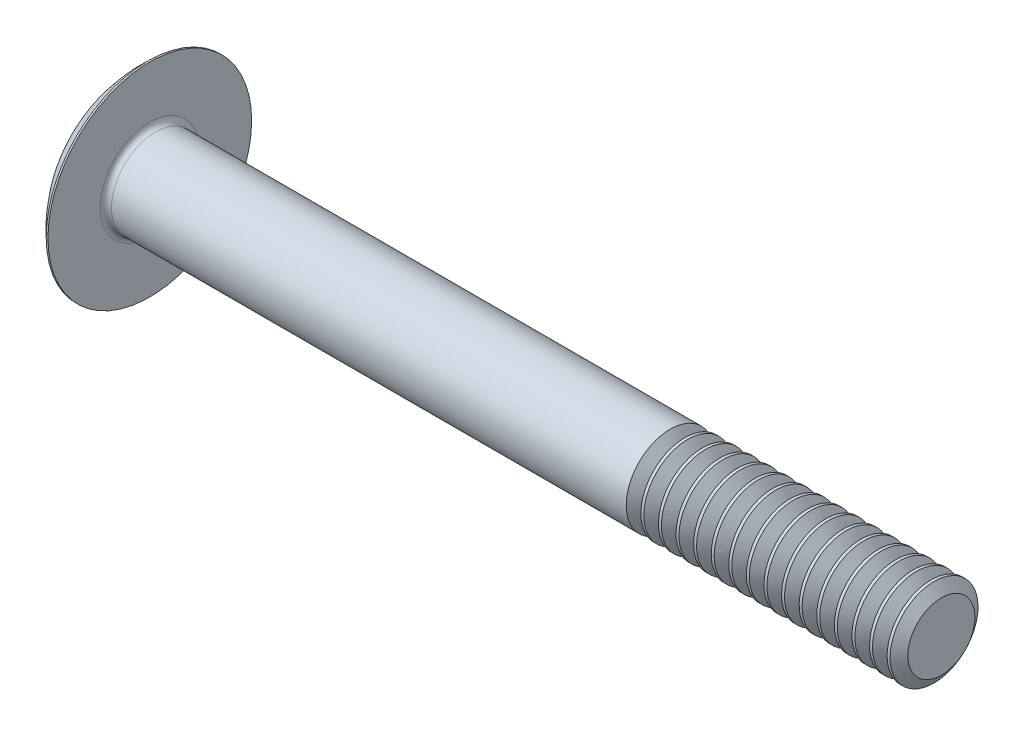
ISO-10303-21;
HEADER;
FILE_DESCRIPTION(('STEP AP214'),'2;1');
FILE_NAME('part.step','',(''),(''),'','','');
FILE_SCHEMA(('AUTOMOTIVE_DESIGN { 1 0 10303 214 1 1 1 1 }'));
ENDSEC;
DATA;
#1=APPLICATION_CONTEXT('core data for automotive mechanical design processes');
#2=APPLICATION_PROTOCOL_DEFINITION('international standard','automotive_design',2000,#1);
#3=PRODUCT_CONTEXT('',#1,'mechanical');
#4=PRODUCT('Part','Part','',(#3));
#5=PRODUCT_RELATED_PRODUCT_CATEGORY('part','',(#4));
#6=PRODUCT_DEFINITION_FORMATION('','',#4);
#7=PRODUCT_DEFINITION_CONTEXT('part definition',#1,'design');
#8=PRODUCT_DEFINITION('design','',#6,#7);
#9=PRODUCT_DEFINITION_SHAPE('','',#8);
#10=(LENGTH_UNIT() NAMED_UNIT(*) SI_UNIT(.MILLI.,.METRE.));
#11=(NAMED_UNIT(*) PLANE_ANGLE_UNIT() SI_UNIT($,.RADIAN.));
#12=(NAMED_UNIT(*) SI_UNIT($,.STERADIAN.) SOLID_ANGLE_UNIT());
#13=UNCERTAINTY_MEASURE_WITH_UNIT(LENGTH_MEASURE(1.E-05),#10,'distance_accuracy_value','');
#14=(GEOMETRIC_REPRESENTATION_CONTEXT(3) GLOBAL_UNCERTAINTY_ASSIGNED_CONTEXT((#13)) GLOBAL_UNIT_ASSIGNED_CONTEXT((#10,
#11,#12)) REPRESENTATION_CONTEXT('',''));
#15=CARTESIAN_POINT('',(0.,0.,0.));
#16=DIRECTION('',(0.,0.,1.));
#17=DIRECTION('',(1.,0.,0.));
#18=AXIS2_PLACEMENT_3D('',#15,#16,#17);
#19=CARTESIAN_POINT('',(9.83861673076924,0.,0.));
#20=DIRECTION('',(-1.,0.,0.));
#21=DIRECTION('',(0.,1.,0.));
#22=AXIS2_PLACEMENT_3D('',#19,#20,#21);
#23=SPHERICAL_SURFACE('',#22,9.83861673076924);
#24=CARTESIAN_POINT('',(3.302,0.,0.));
#25=DIRECTION('',(-1.,0.,0.));
#26=DIRECTION('',(0.,0.,1.));
#27=AXIS2_PLACEMENT_3D('',#24,#25,#26);
#28=CIRCLE('',#27,7.3533);
#29=CARTESIAN_POINT('',(3.302,0.,7.3533));
#30=VERTEX_POINT('',#29);
#31=EDGE_CURVE('E57',#30,#30,#28,.T.);
#32=ORIENTED_EDGE('',*,*,#31,.T.);
#33=EDGE_LOOP('',(#32));
#34=FACE_BOUND('',#33,.T.);
#35=ADVANCED_FACE('F38',(#34),#23,.T.);
#36=CARTESIAN_POINT('',(0.,0.,0.));
#37=DIRECTION('',(-1.,0.,0.));
#38=DIRECTION('',(0.,0.,1.));
#39=AXIS2_PLACEMENT_3D('',#36,#37,#38);
#40=CYLINDRICAL_SURFACE('',#39,3.175);
#41=CARTESIAN_POINT('',(40.9998881737518,0.,0.));
#42=DIRECTION('',(-1.,0.,0.));
#43=DIRECTION('',(0.,-1.,0.));
#44=AXIS2_PLACEMENT_3D('',#41,#42,#43);
#45=CIRCLE('',#44,3.17500000000001);
#46=CARTESIAN_POINT('',(40.9998881737518,-3.175,0.));
#47=VERTEX_POINT('',#46);
#48=EDGE_CURVE('E67',#47,#47,#45,.T.);
#49=ORIENTED_EDGE('',*,*,#48,.T.);
#50=EDGE_LOOP('',(#49));
#51=FACE_BOUND('',#50,.T.);
#52=CARTESIAN_POINT('',(3.8354,0.,0.));
#53=DIRECTION('',(-1.,0.,0.));
#54=DIRECTION('',(0.,0.,1.));
#55=AXIS2_PLACEMENT_3D('',#52,#53,#54);
#56=CIRCLE('',#55,3.175);
#57=CARTESIAN_POINT('',(3.8354,0.,3.175));
#58=VERTEX_POINT('',#57);
#59=EDGE_CURVE('E10',#58,#58,#56,.T.);
#60=ORIENTED_EDGE('',*,*,#59,.F.);
#61=EDGE_LOOP('',(#60));
#62=FACE_BOUND('',#61,.T.);
#63=ADVANCED_FACE('F265',(#51,#62),#40,.T.);
#64=CARTESIAN_POINT('',(3.8354,0.,0.));
#65=DIRECTION('',(-1.,0.,0.));
#66=DIRECTION('',(0.,0.,1.));
#67=AXIS2_PLACEMENT_3D('',#64,#65,#66);
#68=TOROIDAL_SURFACE('',#67,3.5814,0.406399999999999);
#69=CARTESIAN_POINT('',(3.429,0.,0.));
#70=DIRECTION('',(-1.,0.,0.));
#71=DIRECTION('',(0.,0.,1.));
#72=AXIS2_PLACEMENT_3D('',#69,#70,#71);
#73=CIRCLE('',#72,3.5814);
#74=CARTESIAN_POINT('',(3.429,0.,3.5814));
#75=VERTEX_POINT('',#74);
#76=EDGE_CURVE('E45',#75,#75,#73,.T.);
#77=ORIENTED_EDGE('',*,*,#76,.F.);
#78=EDGE_LOOP('',(#77));
#79=FACE_BOUND('',#78,.T.);
#80=ORIENTED_EDGE('',*,*,#59,.T.);
#81=EDGE_LOOP('',(#80));
#82=FACE_BOUND('',#81,.T.);
#83=ADVANCED_FACE('F270',(#79,#82),#68,.F.);
#84=CARTESIAN_POINT('',(3.429,7.3533,0.));
#85=DIRECTION('',(1.,0.,0.));
#86=DIRECTION('',(0.,0.,-1.));
#87=AXIS2_PLACEMENT_3D('',#84,#85,#86);
#88=PLANE('',#87);
#89=ORIENTED_EDGE('',*,*,#76,.T.);
#90=EDGE_LOOP('',(#89));
#91=FACE_BOUND('',#90,.T.);
#92=CARTESIAN_POINT('',(3.429,0.,0.));
#93=DIRECTION('',(-1.,0.,0.));
#94=DIRECTION('',(0.,0.,1.));
#95=AXIS2_PLACEMENT_3D('',#92,#93,#94);
#96=CIRCLE('',#95,7.3533);
#97=CARTESIAN_POINT('',(3.429,0.,7.3533));
#98=VERTEX_POINT('',#97);
#99=EDGE_CURVE('E51',#98,#98,#96,.T.);
#100=ORIENTED_EDGE('',*,*,#99,.F.);
#101=EDGE_LOOP('',(#100));
#102=FACE_BOUND('',#101,.T.);
#103=ADVANCED_FACE('F279',(#91,#102),#88,.T.);
#104=CARTESIAN_POINT('',(0.,0.,0.));
#105=DIRECTION('',(-1.,0.,0.));
#106=DIRECTION('',(0.,0.,1.));
#107=AXIS2_PLACEMENT_3D('',#104,#105,#106);
#108=CYLINDRICAL_SURFACE('',#107,7.3533);
#109=ORIENTED_EDGE('',*,*,#31,.F.);
#110=EDGE_LOOP('',(#109));
#111=FACE_BOUND('',#110,.T.);
#112=ORIENTED_EDGE('',*,*,#99,.T.);
#113=EDGE_LOOP('',(#112));
#114=FACE_BOUND('',#113,.T.);
#115=ADVANCED_FACE('F275',(#111,#114),#108,.T.);
#116=CARTESIAN_POINT('',(42.0581118262482,0.,0.));
#117=DIRECTION('',(1.,0.,0.));
#118=DIRECTION('',(0.,1.,0.));
#119=AXIS2_PLACEMENT_3D('',#116,#117,#118);
#120=CONICAL_SURFACE('',#119,3.17500000000001,0.959931088596882);
#121=CARTESIAN_POINT('',(41.529,0.,0.));
#122=DIRECTION('',(-1.,0.,0.));
#123=DIRECTION('',(0.,-1.,0.));
#124=AXIS2_PLACEMENT_3D('',#121,#122,#123);
#125=CIRCLE('',#124,2.41935000000001);
#126=CARTESIAN_POINT('',(41.529,-2.41935,0.));
#127=VERTEX_POINT('',#126);
#128=EDGE_CURVE('E71',#127,#127,#125,.T.);
#129=ORIENTED_EDGE('',*,*,#128,.F.);
#130=EDGE_LOOP('',(#129));
#131=FACE_BOUND('',#130,.T.);
#132=CARTESIAN_POINT('',(42.0581118262482,0.,0.));
#133=DIRECTION('',(-1.,0.,0.));
#134=DIRECTION('',(0.,-1.,0.));
#135=AXIS2_PLACEMENT_3D('',#132,#133,#134);
#136=CIRCLE('',#135,3.17500000000001);
#137=CARTESIAN_POINT('',(42.0581118262482,-3.175,0.));
#138=VERTEX_POINT('',#137);
#139=EDGE_CURVE('E63',#138,#138,#136,.T.);
#140=ORIENTED_EDGE('',*,*,#139,.T.);
#141=EDGE_LOOP('',(#140));
#142=FACE_BOUND('',#141,.T.);
#143=ADVANCED_FACE('F278',(#131,#142),#120,.T.);
#144=CARTESIAN_POINT('',(41.529,0.,0.));
#145=DIRECTION('',(-1.,0.,0.));
#146=DIRECTION('',(0.,-1.,0.));
#147=AXIS2_PLACEMENT_3D('',#144,#145,#146);
#148=CONICAL_SURFACE('',#147,2.41935000000001,0.959931088596876);
#149=ORIENTED_EDGE('',*,*,#48,.F.);
#150=EDGE_LOOP('',(#149));
#151=FACE_BOUND('',#150,.T.);
#152=ORIENTED_EDGE('',*,*,#128,.T.);
#153=EDGE_LOOP('',(#152));
#154=FACE_BOUND('',#153,.T.);
#155=ADVANCED_FACE('F293',(#151,#154),#148,.T.);
#156=CARTESIAN_POINT('',(42.2698881737518,0.,0.));
#157=DIRECTION('',(-1.,0.,0.));
#158=DIRECTION('',(0.,-1.,0.));
#159=AXIS2_PLACEMENT_3D('',#156,#157,#158);
#160=CIRCLE('',#159,3.17500000000001);
#161=CARTESIAN_POINT('',(42.2698881737518,-3.175,0.));
#162=VERTEX_POINT('',#161);
#163=EDGE_CURVE('E79',#162,#162,#160,.T.);
#164=ORIENTED_EDGE('',*,*,#163,.T.);
#165=EDGE_LOOP('',(#164));
#166=FACE_BOUND('',#165,.T.);
#167=ORIENTED_EDGE('',*,*,#139,.F.);
#168=EDGE_LOOP('',(#167));
#169=FACE_BOUND('',#168,.T.);
#170=ADVANCED_FACE('F272',(#166,#169),#40,.T.);
#171=CARTESIAN_POINT('',(43.3281118262482,0.,0.));
#172=DIRECTION('',(1.,0.,0.));
#173=DIRECTION('',(0.,1.,0.));
#174=AXIS2_PLACEMENT_3D('',#171,#172,#173);
#175=CONICAL_SURFACE('',#174,3.17500000000001,0.959931088596882);
#176=CARTESIAN_POINT('',(42.799,0.,0.));
#177=DIRECTION('',(-1.,0.,0.));
#178=DIRECTION('',(0.,-1.,0.));
#179=AXIS2_PLACEMENT_3D('',#176,#177,#178);
#180=CIRCLE('',#179,2.41935000000001);
#181=CARTESIAN_POINT('',(42.799,-2.41935,0.));
#182=VERTEX_POINT('',#181);
#183=EDGE_CURVE('E83',#182,#182,#180,.T.);
#184=ORIENTED_EDGE('',*,*,#183,.F.);
#185=EDGE_LOOP('',(#184));
#186=FACE_BOUND('',#185,.T.);
#187=CARTESIAN_POINT('',(43.3281118262482,0.,0.));
#188=DIRECTION('',(-1.,0.,0.));
#189=DIRECTION('',(0.,-1.,0.));
#190=AXIS2_PLACEMENT_3D('',#187,#188,#189);
#191=CIRCLE('',#190,3.17500000000001);
#192=CARTESIAN_POINT('',(43.3281118262482,-3.175,0.));
#193=VERTEX_POINT('',#192);
#194=EDGE_CURVE('E75',#193,#193,#191,.T.);
#195=ORIENTED_EDGE('',*,*,#194,.T.);
#196=EDGE_LOOP('',(#195));
#197=FACE_BOUND('',#196,.T.);
#198=ADVANCED_FACE('F298',(#186,#197),#175,.T.);
#199=CARTESIAN_POINT('',(42.799,0.,0.));
#200=DIRECTION('',(-1.,0.,0.));
#201=DIRECTION('',(0.,-1.,0.));
#202=AXIS2_PLACEMENT_3D('',#199,#200,#201);
#203=CONICAL_SURFACE('',#202,2.41935000000001,0.959931088596876);
#204=ORIENTED_EDGE('',*,*,#163,.F.);
#205=EDGE_LOOP('',(#204));
#206=FACE_BOUND('',#205,.T.);
#207=ORIENTED_EDGE('',*,*,#183,.T.);
#208=EDGE_LOOP('',(#207));
#209=FACE_BOUND('',#208,.T.);
#210=ADVANCED_FACE('F301',(#206,#209),#203,.T.);
#211=CARTESIAN_POINT('',(43.5398881737518,0.,0.));
#212=DIRECTION('',(-1.,0.,0.));
#213=DIRECTION('',(0.,-1.,0.));
#214=AXIS2_PLACEMENT_3D('',#211,#212,#213);
#215=CIRCLE('',#214,3.17500000000001);
#216=CARTESIAN_POINT('',(43.5398881737518,-3.175,0.));
#217=VERTEX_POINT('',#216);
#218=EDGE_CURVE('E91',#217,#217,#215,.T.);
#219=ORIENTED_EDGE('',*,*,#218,.T.);
#220=EDGE_LOOP('',(#219));
#221=FACE_BOUND('',#220,.T.);
#222=ORIENTED_EDGE('',*,*,#194,.F.);
#223=EDGE_LOOP('',(#222));
#224=FACE_BOUND('',#223,.T.);
#225=ADVANCED_FACE('F305',(#221,#224),#40,.T.);
#226=CARTESIAN_POINT('',(44.5981118262482,0.,0.));
#227=DIRECTION('',(1.,0.,0.));
#228=DIRECTION('',(0.,1.,0.));
#229=AXIS2_PLACEMENT_3D('',#226,#227,#228);
#230=CONICAL_SURFACE('',#229,3.17500000000001,0.959931088596882);
#231=CARTESIAN_POINT('',(44.069,0.,0.));
#232=DIRECTION('',(-1.,0.,0.));
#233=DIRECTION('',(0.,-1.,0.));
#234=AXIS2_PLACEMENT_3D('',#231,#232,#233);
#235=CIRCLE('',#234,2.41935000000001);
#236=CARTESIAN_POINT('',(44.069,-2.41935,0.));
#237=VERTEX_POINT('',#236);
#238=EDGE_CURVE('E95',#237,#237,#235,.T.);
#239=ORIENTED_EDGE('',*,*,#238,.F.);
#240=EDGE_LOOP('',(#239));
#241=FACE_BOUND('',#240,.T.);
#242=CARTESIAN_POINT('',(44.5981118262482,0.,0.));
#243=DIRECTION('',(-1.,0.,0.));
#244=DIRECTION('',(0.,-1.,0.));
#245=AXIS2_PLACEMENT_3D('',#242,#243,#244);
#246=CIRCLE('',#245,3.17500000000001);
#247=CARTESIAN_POINT('',(44.5981118262482,-3.175,0.));
#248=VERTEX_POINT('',#247);
#249=EDGE_CURVE('E87',#248,#248,#246,.T.);
#250=ORIENTED_EDGE('',*,*,#249,.T.);
#251=EDGE_LOOP('',(#250));
#252=FACE_BOUND('',#251,.T.);
#253=ADVANCED_FACE('F307',(#241,#252),#230,.T.);
#254=CARTESIAN_POINT('',(44.069,0.,0.));
#255=DIRECTION('',(-1.,0.,0.));
#256=DIRECTION('',(0.,-1.,0.));
#257=AXIS2_PLACEMENT_3D('',#254,#255,#256);
#258=CONICAL_SURFACE('',#257,2.41935000000001,0.959931088596876);
#259=ORIENTED_EDGE('',*,*,#218,.F.);
#260=EDGE_LOOP('',(#259));
#261=FACE_BOUND('',#260,.T.);
#262=ORIENTED_EDGE('',*,*,#238,.T.);
#263=EDGE_LOOP('',(#262));
#264=FACE_BOUND('',#263,.T.);
#265=ADVANCED_FACE('F310',(#261,#264),#258,.T.);
#266=CARTESIAN_POINT('',(44.8098881737518,0.,0.));
#267=DIRECTION('',(-1.,0.,0.));
#268=DIRECTION('',(0.,-1.,0.));
#269=AXIS2_PLACEMENT_3D('',#266,#267,#268);
#270=CIRCLE('',#269,3.17500000000001);
#271=CARTESIAN_POINT('',(44.8098881737518,-3.175,0.));
#272=VERTEX_POINT('',#271);
#273=EDGE_CURVE('E103',#272,#272,#270,.T.);
#274=ORIENTED_EDGE('',*,*,#273,.T.);
#275=EDGE_LOOP('',(#274));
#276=FACE_BOUND('',#275,.T.);
#277=ORIENTED_EDGE('',*,*,#249,.F.);
#278=EDGE_LOOP('',(#277));
#279=FACE_BOUND('',#278,.T.);
#280=ADVANCED_FACE('F314',(#276,#279),#40,.T.);
#281=CARTESIAN_POINT('',(45.8681118262482,0.,0.));
#282=DIRECTION('',(1.,0.,0.));
#283=DIRECTION('',(0.,1.,0.));
#284=AXIS2_PLACEMENT_3D('',#281,#282,#283);
#285=CONICAL_SURFACE('',#284,3.17500000000001,0.959931088596882);
#286=CARTESIAN_POINT('',(45.339,0.,0.));
#287=DIRECTION('',(-1.,0.,0.));
#288=DIRECTION('',(0.,-1.,0.));
#289=AXIS2_PLACEMENT_3D('',#286,#287,#288);
#290=CIRCLE('',#289,2.41935000000001);
#291=CARTESIAN_POINT('',(45.339,-2.41935,0.));
#292=VERTEX_POINT('',#291);
#293=EDGE_CURVE('E107',#292,#292,#290,.T.);
#294=ORIENTED_EDGE('',*,*,#293,.F.);
#295=EDGE_LOOP('',(#294));
#296=FACE_BOUND('',#295,.T.);
#297=CARTESIAN_POINT('',(45.8681118262482,0.,0.));
#298=DIRECTION('',(-1.,0.,0.));
#299=DIRECTION('',(0.,-1.,0.));
#300=AXIS2_PLACEMENT_3D('',#297,#298,#299);
#301=CIRCLE('',#300,3.17500000000001);
#302=CARTESIAN_POINT('',(45.8681118262482,-3.175,0.));
#303=VERTEX_POINT('',#302);
#304=EDGE_CURVE('E99',#303,#303,#301,.T.);
#305=ORIENTED_EDGE('',*,*,#304,.T.);
#306=EDGE_LOOP('',(#305));
#307=FACE_BOUND('',#306,.T.);
#308=ADVANCED_FACE('F316',(#296,#307),#285,.T.);
#309=CARTESIAN_POINT('',(45.339,0.,0.));
#310=DIRECTION('',(-1.,0.,0.));
#311=DIRECTION('',(0.,-1.,0.));
#312=AXIS2_PLACEMENT_3D('',#309,#310,#311);
#313=CONICAL_SURFACE('',#312,2.41935000000001,0.959931088596876);
#314=ORIENTED_EDGE('',*,*,#273,.F.);
#315=EDGE_LOOP('',(#314));
#316=FACE_BOUND('',#315,.T.);
#317=ORIENTED_EDGE('',*,*,#293,.T.);
#318=EDGE_LOOP('',(#317));
#319=FACE_BOUND('',#318,.T.);
#320=ADVANCED_FACE('F319',(#316,#319),#313,.T.);
#321=CARTESIAN_POINT('',(46.0798881737518,0.,0.));
#322=DIRECTION('',(-1.,0.,0.));
#323=DIRECTION('',(0.,-1.,0.));
#324=AXIS2_PLACEMENT_3D('',#321,#322,#323);
#325=CIRCLE('',#324,3.17500000000001);
#326=CARTESIAN_POINT('',(46.0798881737518,-3.175,0.));
#327=VERTEX_POINT('',#326);
#328=EDGE_CURVE('E115',#327,#327,#325,.T.);
#329=ORIENTED_EDGE('',*,*,#328,.T.);
#330=EDGE_LOOP('',(#329));
#331=FACE_BOUND('',#330,.T.);
#332=ORIENTED_EDGE('',*,*,#304,.F.);
#333=EDGE_LOOP('',(#332));
#334=FACE_BOUND('',#333,.T.);
#335=ADVANCED_FACE('F323',(#331,#334),#40,.T.);
#336=CARTESIAN_POINT('',(47.1381118262482,0.,0.));
#337=DIRECTION('',(1.,0.,0.));
#338=DIRECTION('',(0.,1.,0.));
#339=AXIS2_PLACEMENT_3D('',#336,#337,#338);
#340=CONICAL_SURFACE('',#339,3.17500000000001,0.959931088596882);
#341=CARTESIAN_POINT('',(46.609,0.,0.));
#342=DIRECTION('',(-1.,0.,0.));
#343=DIRECTION('',(0.,-1.,0.));
#344=AXIS2_PLACEMENT_3D('',#341,#342,#343);
#345=CIRCLE('',#344,2.41935000000001);
#346=CARTESIAN_POINT('',(46.609,-2.41935,0.));
#347=VERTEX_POINT('',#346);
#348=EDGE_CURVE('E119',#347,#347,#345,.T.);
#349=ORIENTED_EDGE('',*,*,#348,.F.);
#350=EDGE_LOOP('',(#349));
#351=FACE_BOUND('',#350,.T.);
#352=CARTESIAN_POINT('',(47.1381118262482,0.,0.));
#353=DIRECTION('',(-1.,0.,0.));
#354=DIRECTION('',(0.,-1.,0.));
#355=AXIS2_PLACEMENT_3D('',#352,#353,#354);
#356=CIRCLE('',#355,3.17500000000001);
#357=CARTESIAN_POINT('',(47.1381118262482,-3.175,0.));
#358=VERTEX_POINT('',#357);
#359=EDGE_CURVE('E111',#358,#358,#356,.T.);
#360=ORIENTED_EDGE('',*,*,#359,.T.);
#361=EDGE_LOOP('',(#360));
#362=FACE_BOUND('',#361,.T.);
#363=ADVANCED_FACE('F325',(#351,#362),#340,.T.);
#364=CARTESIAN_POINT('',(46.609,0.,0.));
#365=DIRECTION('',(-1.,0.,0.));
#366=DIRECTION('',(0.,-1.,0.));
#367=AXIS2_PLACEMENT_3D('',#364,#365,#366);
#368=CONICAL_SURFACE('',#367,2.41935000000001,0.959931088596876);
#369=ORIENTED_EDGE('',*,*,#328,.F.);
#370=EDGE_LOOP('',(#369));
#371=FACE_BOUND('',#370,.T.);
#372=ORIENTED_EDGE('',*,*,#348,.T.);
#373=EDGE_LOOP('',(#372));
#374=FACE_BOUND('',#373,.T.);
#375=ADVANCED_FACE('F328',(#371,#374),#368,.T.);
#376=CARTESIAN_POINT('',(47.3498881737518,0.,0.));
#377=DIRECTION('',(-1.,0.,0.));
#378=DIRECTION('',(0.,-1.,0.));
#379=AXIS2_PLACEMENT_3D('',#376,#377,#378);
#380=CIRCLE('',#379,3.17500000000001);
#381=CARTESIAN_POINT('',(47.3498881737518,-3.175,0.));
#382=VERTEX_POINT('',#381);
#383=EDGE_CURVE('E127',#382,#382,#380,.T.);
#384=ORIENTED_EDGE('',*,*,#383,.T.);
#385=EDGE_LOOP('',(#384));
#386=FACE_BOUND('',#385,.T.);
#387=ORIENTED_EDGE('',*,*,#359,.F.);
#388=EDGE_LOOP('',(#387));
#389=FACE_BOUND('',#388,.T.);
#390=ADVANCED_FACE('F332',(#386,#389),#40,.T.);
#391=CARTESIAN_POINT('',(48.4081118262482,0.,0.));
#392=DIRECTION('',(1.,0.,0.));
#393=DIRECTION('',(0.,1.,0.));
#394=AXIS2_PLACEMENT_3D('',#391,#392,#393);
#395=CONICAL_SURFACE('',#394,3.17500000000001,0.959931088596882);
#396=CARTESIAN_POINT('',(47.879,0.,0.));
#397=DIRECTION('',(-1.,0.,0.));
#398=DIRECTION('',(0.,-1.,0.));
#399=AXIS2_PLACEMENT_3D('',#396,#397,#398);
#400=CIRCLE('',#399,2.41935000000001);
#401=CARTESIAN_POINT('',(47.879,-2.41935,0.));
#402=VERTEX_POINT('',#401);
#403=EDGE_CURVE('E131',#402,#402,#400,.T.);
#404=ORIENTED_EDGE('',*,*,#403,.F.);
#405=EDGE_LOOP('',(#404));
#406=FACE_BOUND('',#405,.T.);
#407=CARTESIAN_POINT('',(48.4081118262482,0.,0.));
#408=DIRECTION('',(-1.,0.,0.));
#409=DIRECTION('',(0.,-1.,0.));
#410=AXIS2_PLACEMENT_3D('',#407,#408,#409);
#411=CIRCLE('',#410,3.17500000000001);
#412=CARTESIAN_POINT('',(48.4081118262482,-3.175,0.));
#413=VERTEX_POINT('',#412);
#414=EDGE_CURVE('E123',#413,#413,#411,.T.);
#415=ORIENTED_EDGE('',*,*,#414,.T.);
#416=EDGE_LOOP('',(#415));
#417=FACE_BOUND('',#416,.T.);
#418=ADVANCED_FACE('F334',(#406,#417),#395,.T.);
#419=CARTESIAN_POINT('',(47.879,0.,0.));
#420=DIRECTION('',(-1.,0.,0.));
#421=DIRECTION('',(0.,-1.,0.));
#422=AXIS2_PLACEMENT_3D('',#419,#420,#421);
#423=CONICAL_SURFACE('',#422,2.41935000000001,0.959931088596876);
#424=ORIENTED_EDGE('',*,*,#383,.F.);
#425=EDGE_LOOP('',(#424));
#426=FACE_BOUND('',#425,.T.);
#427=ORIENTED_EDGE('',*,*,#403,.T.);
#428=EDGE_LOOP('',(#427));
#429=FACE_BOUND('',#428,.T.);
#430=ADVANCED_FACE('F337',(#426,#429),#423,.T.);
#431=CARTESIAN_POINT('',(48.6198881737518,0.,0.));
#432=DIRECTION('',(-1.,0.,0.));
#433=DIRECTION('',(0.,-1.,0.));
#434=AXIS2_PLACEMENT_3D('',#431,#432,#433);
#435=CIRCLE('',#434,3.17500000000001);
#436=CARTESIAN_POINT('',(48.6198881737518,-3.175,0.));
#437=VERTEX_POINT('',#436);
#438=EDGE_CURVE('E139',#437,#437,#435,.T.);
#439=ORIENTED_EDGE('',*,*,#438,.T.);
#440=EDGE_LOOP('',(#439));
#441=FACE_BOUND('',#440,.T.);
#442=ORIENTED_EDGE('',*,*,#414,.F.);
#443=EDGE_LOOP('',(#442));
#444=FACE_BOUND('',#443,.T.);
#445=ADVANCED_FACE('F341',(#441,#444),#40,.T.);
#446=CARTESIAN_POINT('',(49.6781118262482,0.,0.));
#447=DIRECTION('',(1.,0.,0.));
#448=DIRECTION('',(0.,1.,0.));
#449=AXIS2_PLACEMENT_3D('',#446,#447,#448);
#450=CONICAL_SURFACE('',#449,3.17500000000001,0.959931088596882);
#451=CARTESIAN_POINT('',(49.149,0.,0.));
#452=DIRECTION('',(-1.,0.,0.));
#453=DIRECTION('',(0.,-1.,0.));
#454=AXIS2_PLACEMENT_3D('',#451,#452,#453);
#455=CIRCLE('',#454,2.41935000000001);
#456=CARTESIAN_POINT('',(49.149,-2.41935,0.));
#457=VERTEX_POINT('',#456);
#458=EDGE_CURVE('E143',#457,#457,#455,.T.);
#459=ORIENTED_EDGE('',*,*,#458,.F.);
#460=EDGE_LOOP('',(#459));
#461=FACE_BOUND('',#460,.T.);
#462=CARTESIAN_POINT('',(49.6781118262482,0.,0.));
#463=DIRECTION('',(-1.,0.,0.));
#464=DIRECTION('',(0.,-1.,0.));
#465=AXIS2_PLACEMENT_3D('',#462,#463,#464);
#466=CIRCLE('',#465,3.17500000000001);
#467=CARTESIAN_POINT('',(49.6781118262482,-3.175,0.));
#468=VERTEX_POINT('',#467);
#469=EDGE_CURVE('E135',#468,#468,#466,.T.);
#470=ORIENTED_EDGE('',*,*,#469,.T.);
#471=EDGE_LOOP('',(#470));
#472=FACE_BOUND('',#471,.T.);
#473=ADVANCED_FACE('F343',(#461,#472),#450,.T.);
#474=CARTESIAN_POINT('',(49.149,0.,0.));
#475=DIRECTION('',(-1.,0.,0.));
#476=DIRECTION('',(0.,-1.,0.));
#477=AXIS2_PLACEMENT_3D('',#474,#475,#476);
#478=CONICAL_SURFACE('',#477,2.41935000000001,0.959931088596876);
#479=ORIENTED_EDGE('',*,*,#438,.F.);
#480=EDGE_LOOP('',(#479));
#481=FACE_BOUND('',#480,.T.);
#482=ORIENTED_EDGE('',*,*,#458,.T.);
#483=EDGE_LOOP('',(#482));
#484=FACE_BOUND('',#483,.T.);
#485=ADVANCED_FACE('F346',(#481,#484),#478,.T.);
#486=CARTESIAN_POINT('',(49.8898881737518,0.,0.));
#487=DIRECTION('',(-1.,0.,0.));
#488=DIRECTION('',(0.,-1.,0.));
#489=AXIS2_PLACEMENT_3D('',#486,#487,#488);
#490=CIRCLE('',#489,3.17500000000001);
#491=CARTESIAN_POINT('',(49.8898881737518,-3.175,0.));
#492=VERTEX_POINT('',#491);
#493=EDGE_CURVE('E151',#492,#492,#490,.T.);
#494=ORIENTED_EDGE('',*,*,#493,.T.);
#495=EDGE_LOOP('',(#494));
#496=FACE_BOUND('',#495,.T.);
#497=ORIENTED_EDGE('',*,*,#469,.F.);
#498=EDGE_LOOP('',(#497));
#499=FACE_BOUND('',#498,.T.);
#500=ADVANCED_FACE('F350',(#496,#499),#40,.T.);
#501=CARTESIAN_POINT('',(50.9481118262482,0.,0.));
#502=DIRECTION('',(1.,0.,0.));
#503=DIRECTION('',(0.,1.,0.));
#504=AXIS2_PLACEMENT_3D('',#501,#502,#503);
#505=CONICAL_SURFACE('',#504,3.17500000000001,0.959931088596882);
#506=CARTESIAN_POINT('',(50.419,0.,0.));
#507=DIRECTION('',(-1.,0.,0.));
#508=DIRECTION('',(0.,-1.,0.));
#509=AXIS2_PLACEMENT_3D('',#506,#507,#508);
#510=CIRCLE('',#509,2.41935000000001);
#511=CARTESIAN_POINT('',(50.419,-2.41935,0.));
#512=VERTEX_POINT('',#511);
#513=EDGE_CURVE('E155',#512,#512,#510,.T.);
#514=ORIENTED_EDGE('',*,*,#513,.F.);
#515=EDGE_LOOP('',(#514));
#516=FACE_BOUND('',#515,.T.);
#517=CARTESIAN_POINT('',(50.9481118262482,0.,0.));
#518=DIRECTION('',(-1.,0.,0.));
#519=DIRECTION('',(0.,-1.,0.));
#520=AXIS2_PLACEMENT_3D('',#517,#518,#519);
#521=CIRCLE('',#520,3.17500000000001);
#522=CARTESIAN_POINT('',(50.9481118262482,-3.175,0.));
#523=VERTEX_POINT('',#522);
#524=EDGE_CURVE('E147',#523,#523,#521,.T.);
#525=ORIENTED_EDGE('',*,*,#524,.T.);
#526=EDGE_LOOP('',(#525));
#527=FACE_BOUND('',#526,.T.);
#528=ADVANCED_FACE('F352',(#516,#527),#505,.T.);
#529=CARTESIAN_POINT('',(50.419,0.,0.));
#530=DIRECTION('',(-1.,0.,0.));
#531=DIRECTION('',(0.,-1.,0.));
#532=AXIS2_PLACEMENT_3D('',#529,#530,#531);
#533=CONICAL_SURFACE('',#532,2.41935000000001,0.959931088596876);
#534=ORIENTED_EDGE('',*,*,#493,.F.);
#535=EDGE_LOOP('',(#534));
#536=FACE_BOUND('',#535,.T.);
#537=ORIENTED_EDGE('',*,*,#513,.T.);
#538=EDGE_LOOP('',(#537));
#539=FACE_BOUND('',#538,.T.);
#540=ADVANCED_FACE('F355',(#536,#539),#533,.T.);
#541=CARTESIAN_POINT('',(51.1598881737518,0.,0.));
#542=DIRECTION('',(-1.,0.,0.));
#543=DIRECTION('',(0.,-1.,0.));
#544=AXIS2_PLACEMENT_3D('',#541,#542,#543);
#545=CIRCLE('',#544,3.17500000000001);
#546=CARTESIAN_POINT('',(51.1598881737518,-3.175,0.));
#547=VERTEX_POINT('',#546);
#548=EDGE_CURVE('E163',#547,#547,#545,.T.);
#549=ORIENTED_EDGE('',*,*,#548,.T.);
#550=EDGE_LOOP('',(#549));
#551=FACE_BOUND('',#550,.T.);
#552=ORIENTED_EDGE('',*,*,#524,.F.);
#553=EDGE_LOOP('',(#552));
#554=FACE_BOUND('',#553,.T.);
#555=ADVANCED_FACE('F359',(#551,#554),#40,.T.);
#556=CARTESIAN_POINT('',(52.2181118262482,0.,0.));
#557=DIRECTION('',(1.,0.,0.));
#558=DIRECTION('',(0.,1.,0.));
#559=AXIS2_PLACEMENT_3D('',#556,#557,#558);
#560=CONICAL_SURFACE('',#559,3.17500000000001,0.959931088596882);
#561=CARTESIAN_POINT('',(51.689,0.,0.));
#562=DIRECTION('',(-1.,0.,0.));
#563=DIRECTION('',(0.,-1.,0.));
#564=AXIS2_PLACEMENT_3D('',#561,#562,#563);
#565=CIRCLE('',#564,2.41935000000001);
#566=CARTESIAN_POINT('',(51.689,-2.41935,0.));
#567=VERTEX_POINT('',#566);
#568=EDGE_CURVE('E167',#567,#567,#565,.T.);
#569=ORIENTED_EDGE('',*,*,#568,.F.);
#570=EDGE_LOOP('',(#569));
#571=FACE_BOUND('',#570,.T.);
#572=CARTESIAN_POINT('',(52.2181118262482,0.,0.));
#573=DIRECTION('',(-1.,0.,0.));
#574=DIRECTION('',(0.,-1.,0.));
#575=AXIS2_PLACEMENT_3D('',#572,#573,#574);
#576=CIRCLE('',#575,3.17500000000001);
#577=CARTESIAN_POINT('',(52.2181118262482,-3.175,0.));
#578=VERTEX_POINT('',#577);
#579=EDGE_CURVE('E159',#578,#578,#576,.T.);
#580=ORIENTED_EDGE('',*,*,#579,.T.);
#581=EDGE_LOOP('',(#580));
#582=FACE_BOUND('',#581,.T.);
#583=ADVANCED_FACE('F361',(#571,#582),#560,.T.);
#584=CARTESIAN_POINT('',(51.689,0.,0.));
#585=DIRECTION('',(-1.,0.,0.));
#586=DIRECTION('',(0.,-1.,0.));
#587=AXIS2_PLACEMENT_3D('',#584,#585,#586);
#588=CONICAL_SURFACE('',#587,2.41935000000001,0.959931088596876);
#589=ORIENTED_EDGE('',*,*,#548,.F.);
#590=EDGE_LOOP('',(#589));
#591=FACE_BOUND('',#590,.T.);
#592=ORIENTED_EDGE('',*,*,#568,.T.);
#593=EDGE_LOOP('',(#592));
#594=FACE_BOUND('',#593,.T.);
#595=ADVANCED_FACE('F364',(#591,#594),#588,.T.);
#596=CARTESIAN_POINT('',(52.4298881737518,0.,0.));
#597=DIRECTION('',(-1.,0.,0.));
#598=DIRECTION('',(0.,-1.,0.));
#599=AXIS2_PLACEMENT_3D('',#596,#597,#598);
#600=CIRCLE('',#599,3.17500000000001);
#601=CARTESIAN_POINT('',(52.4298881737518,-3.175,0.));
#602=VERTEX_POINT('',#601);
#603=EDGE_CURVE('E175',#602,#602,#600,.T.);
#604=ORIENTED_EDGE('',*,*,#603,.T.);
#605=EDGE_LOOP('',(#604));
#606=FACE_BOUND('',#605,.T.);
#607=ORIENTED_EDGE('',*,*,#579,.F.);
#608=EDGE_LOOP('',(#607));
#609=FACE_BOUND('',#608,.T.);
#610=ADVANCED_FACE('F368',(#606,#609),#40,.T.);
#611=CARTESIAN_POINT('',(53.4881118262482,0.,0.));
#612=DIRECTION('',(1.,0.,0.));
#613=DIRECTION('',(0.,1.,0.));
#614=AXIS2_PLACEMENT_3D('',#611,#612,#613);
#615=CONICAL_SURFACE('',#614,3.17500000000001,0.959931088596882);
#616=CARTESIAN_POINT('',(52.959,0.,0.));
#617=DIRECTION('',(-1.,0.,0.));
#618=DIRECTION('',(0.,-1.,0.));
#619=AXIS2_PLACEMENT_3D('',#616,#617,#618);
#620=CIRCLE('',#619,2.41935000000001);
#621=CARTESIAN_POINT('',(52.959,-2.41935,0.));
#622=VERTEX_POINT('',#621);
#623=EDGE_CURVE('E179',#622,#622,#620,.T.);
#624=ORIENTED_EDGE('',*,*,#623,.F.);
#625=EDGE_LOOP('',(#624));
#626=FACE_BOUND('',#625,.T.);
#627=CARTESIAN_POINT('',(53.4881118262482,0.,0.));
#628=DIRECTION('',(-1.,0.,0.));
#629=DIRECTION('',(0.,-1.,0.));
#630=AXIS2_PLACEMENT_3D('',#627,#628,#629);
#631=CIRCLE('',#630,3.17500000000001);
#632=CARTESIAN_POINT('',(53.4881118262482,-3.175,0.));
#633=VERTEX_POINT('',#632);
#634=EDGE_CURVE('E171',#633,#633,#631,.T.);
#635=ORIENTED_EDGE('',*,*,#634,.T.);
#636=EDGE_LOOP('',(#635));
#637=FACE_BOUND('',#636,.T.);
#638=ADVANCED_FACE('F370',(#626,#637),#615,.T.);
#639=CARTESIAN_POINT('',(52.959,0.,0.));
#640=DIRECTION('',(-1.,0.,0.));
#641=DIRECTION('',(0.,-1.,0.));
#642=AXIS2_PLACEMENT_3D('',#639,#640,#641);
#643=CONICAL_SURFACE('',#642,2.41935000000001,0.959931088596876);
#644=ORIENTED_EDGE('',*,*,#603,.F.);
#645=EDGE_LOOP('',(#644));
#646=FACE_BOUND('',#645,.T.);
#647=ORIENTED_EDGE('',*,*,#623,.T.);
#648=EDGE_LOOP('',(#647));
#649=FACE_BOUND('',#648,.T.);
#650=ADVANCED_FACE('F373',(#646,#649),#643,.T.);
#651=CARTESIAN_POINT('',(53.6998881737518,0.,0.));
#652=DIRECTION('',(-1.,0.,0.));
#653=DIRECTION('',(0.,-1.,0.));
#654=AXIS2_PLACEMENT_3D('',#651,#652,#653);
#655=CIRCLE('',#654,3.17500000000001);
#656=CARTESIAN_POINT('',(53.6998881737518,-3.175,0.));
#657=VERTEX_POINT('',#656);
#658=EDGE_CURVE('E187',#657,#657,#655,.T.);
#659=ORIENTED_EDGE('',*,*,#658,.T.);
#660=EDGE_LOOP('',(#659));
#661=FACE_BOUND('',#660,.T.);
#662=ORIENTED_EDGE('',*,*,#634,.F.);
#663=EDGE_LOOP('',(#662));
#664=FACE_BOUND('',#663,.T.);
#665=ADVANCED_FACE('F377',(#661,#664),#40,.T.);
#666=CARTESIAN_POINT('',(54.7581118262482,0.,0.));
#667=DIRECTION('',(1.,0.,0.));
#668=DIRECTION('',(0.,1.,0.));
#669=AXIS2_PLACEMENT_3D('',#666,#667,#668);
#670=CONICAL_SURFACE('',#669,3.17500000000001,0.959931088596882);
#671=CARTESIAN_POINT('',(54.229,0.,0.));
#672=DIRECTION('',(-1.,0.,0.));
#673=DIRECTION('',(0.,-1.,0.));
#674=AXIS2_PLACEMENT_3D('',#671,#672,#673);
#675=CIRCLE('',#674,2.41935000000001);
#676=CARTESIAN_POINT('',(54.229,-2.41935,0.));
#677=VERTEX_POINT('',#676);
#678=EDGE_CURVE('E191',#677,#677,#675,.T.);
#679=ORIENTED_EDGE('',*,*,#678,.F.);
#680=EDGE_LOOP('',(#679));
#681=FACE_BOUND('',#680,.T.);
#682=CARTESIAN_POINT('',(54.7581118262482,0.,0.));
#683=DIRECTION('',(-1.,0.,0.));
#684=DIRECTION('',(0.,-1.,0.));
#685=AXIS2_PLACEMENT_3D('',#682,#683,#684);
#686=CIRCLE('',#685,3.17500000000001);
#687=CARTESIAN_POINT('',(54.7581118262482,-3.175,0.));
#688=VERTEX_POINT('',#687);
#689=EDGE_CURVE('E183',#688,#688,#686,.T.);
#690=ORIENTED_EDGE('',*,*,#689,.T.);
#691=EDGE_LOOP('',(#690));
#692=FACE_BOUND('',#691,.T.);
#693=ADVANCED_FACE('F379',(#681,#692),#670,.T.);
#694=CARTESIAN_POINT('',(54.229,0.,0.));
#695=DIRECTION('',(-1.,0.,0.));
#696=DIRECTION('',(0.,-1.,0.));
#697=AXIS2_PLACEMENT_3D('',#694,#695,#696);
#698=CONICAL_SURFACE('',#697,2.41935000000001,0.959931088596876);
#699=ORIENTED_EDGE('',*,*,#658,.F.);
#700=EDGE_LOOP('',(#699));
#701=FACE_BOUND('',#700,.T.);
#702=ORIENTED_EDGE('',*,*,#678,.T.);
#703=EDGE_LOOP('',(#702));
#704=FACE_BOUND('',#703,.T.);
#705=ADVANCED_FACE('F382',(#701,#704),#698,.T.);
#706=CARTESIAN_POINT('',(54.9698881737518,0.,0.));
#707=DIRECTION('',(-1.,0.,0.));
#708=DIRECTION('',(0.,-1.,0.));
#709=AXIS2_PLACEMENT_3D('',#706,#707,#708);
#710=CIRCLE('',#709,3.17500000000001);
#711=CARTESIAN_POINT('',(54.9698881737518,-3.175,0.));
#712=VERTEX_POINT('',#711);
#713=EDGE_CURVE('E199',#712,#712,#710,.T.);
#714=ORIENTED_EDGE('',*,*,#713,.T.);
#715=EDGE_LOOP('',(#714));
#716=FACE_BOUND('',#715,.T.);
#717=ORIENTED_EDGE('',*,*,#689,.F.);
#718=EDGE_LOOP('',(#717));
#719=FACE_BOUND('',#718,.T.);
#720=ADVANCED_FACE('F386',(#716,#719),#40,.T.);
#721=CARTESIAN_POINT('',(56.0281118262482,0.,0.));
#722=DIRECTION('',(1.,0.,0.));
#723=DIRECTION('',(0.,1.,0.));
#724=AXIS2_PLACEMENT_3D('',#721,#722,#723);
#725=CONICAL_SURFACE('',#724,3.17500000000001,0.959931088596882);
#726=CARTESIAN_POINT('',(55.499,0.,0.));
#727=DIRECTION('',(-1.,0.,0.));
#728=DIRECTION('',(0.,-1.,0.));
#729=AXIS2_PLACEMENT_3D('',#726,#727,#728);
#730=CIRCLE('',#729,2.41935000000001);
#731=CARTESIAN_POINT('',(55.499,-2.41935,0.));
#732=VERTEX_POINT('',#731);
#733=EDGE_CURVE('E203',#732,#732,#730,.T.);
#734=ORIENTED_EDGE('',*,*,#733,.F.);
#735=EDGE_LOOP('',(#734));
#736=FACE_BOUND('',#735,.T.);
#737=CARTESIAN_POINT('',(56.0281118262482,0.,0.));
#738=DIRECTION('',(-1.,0.,0.));
#739=DIRECTION('',(0.,-1.,0.));
#740=AXIS2_PLACEMENT_3D('',#737,#738,#739);
#741=CIRCLE('',#740,3.17500000000001);
#742=CARTESIAN_POINT('',(56.0281118262482,-3.175,0.));
#743=VERTEX_POINT('',#742);
#744=EDGE_CURVE('E195',#743,#743,#741,.T.);
#745=ORIENTED_EDGE('',*,*,#744,.T.);
#746=EDGE_LOOP('',(#745));
#747=FACE_BOUND('',#746,.T.);
#748=ADVANCED_FACE('F388',(#736,#747),#725,.T.);
#749=CARTESIAN_POINT('',(55.499,0.,0.));
#750=DIRECTION('',(-1.,0.,0.));
#751=DIRECTION('',(0.,-1.,0.));
#752=AXIS2_PLACEMENT_3D('',#749,#750,#751);
#753=CONICAL_SURFACE('',#752,2.41935000000001,0.959931088596876);
#754=ORIENTED_EDGE('',*,*,#713,.F.);
#755=EDGE_LOOP('',(#754));
#756=FACE_BOUND('',#755,.T.);
#757=ORIENTED_EDGE('',*,*,#733,.T.);
#758=EDGE_LOOP('',(#757));
#759=FACE_BOUND('',#758,.T.);
#760=ADVANCED_FACE('F391',(#756,#759),#753,.T.);
#761=CARTESIAN_POINT('',(56.2398881737518,0.,0.));
#762=DIRECTION('',(-1.,0.,0.));
#763=DIRECTION('',(0.,-1.,0.));
#764=AXIS2_PLACEMENT_3D('',#761,#762,#763);
#765=CIRCLE('',#764,3.17500000000001);
#766=CARTESIAN_POINT('',(56.2398881737518,-3.175,0.));
#767=VERTEX_POINT('',#766);
#768=EDGE_CURVE('E211',#767,#767,#765,.T.);
#769=ORIENTED_EDGE('',*,*,#768,.T.);
#770=EDGE_LOOP('',(#769));
#771=FACE_BOUND('',#770,.T.);
#772=ORIENTED_EDGE('',*,*,#744,.F.);
#773=EDGE_LOOP('',(#772));
#774=FACE_BOUND('',#773,.T.);
#775=ADVANCED_FACE('F395',(#771,#774),#40,.T.);
#776=CARTESIAN_POINT('',(57.2981118262482,0.,0.));
#777=DIRECTION('',(1.,0.,0.));
#778=DIRECTION('',(0.,1.,0.));
#779=AXIS2_PLACEMENT_3D('',#776,#777,#778);
#780=CONICAL_SURFACE('',#779,3.17500000000001,0.959931088596882);
#781=CARTESIAN_POINT('',(56.769,0.,0.));
#782=DIRECTION('',(-1.,0.,0.));
#783=DIRECTION('',(0.,-1.,0.));
#784=AXIS2_PLACEMENT_3D('',#781,#782,#783);
#785=CIRCLE('',#784,2.41935000000001);
#786=CARTESIAN_POINT('',(56.769,-2.41935,0.));
#787=VERTEX_POINT('',#786);
#788=EDGE_CURVE('E215',#787,#787,#785,.T.);
#789=ORIENTED_EDGE('',*,*,#788,.F.);
#790=EDGE_LOOP('',(#789));
#791=FACE_BOUND('',#790,.T.);
#792=CARTESIAN_POINT('',(57.2981118262482,0.,0.));
#793=DIRECTION('',(-1.,0.,0.));
#794=DIRECTION('',(0.,-1.,0.));
#795=AXIS2_PLACEMENT_3D('',#792,#793,#794);
#796=CIRCLE('',#795,3.17500000000001);
#797=CARTESIAN_POINT('',(57.2981118262482,-3.175,0.));
#798=VERTEX_POINT('',#797);
#799=EDGE_CURVE('E207',#798,#798,#796,.T.);
#800=ORIENTED_EDGE('',*,*,#799,.T.);
#801=EDGE_LOOP('',(#800));
#802=FACE_BOUND('',#801,.T.);
#803=ADVANCED_FACE('F397',(#791,#802),#780,.T.);
#804=CARTESIAN_POINT('',(56.769,0.,0.));
#805=DIRECTION('',(-1.,0.,0.));
#806=DIRECTION('',(0.,-1.,0.));
#807=AXIS2_PLACEMENT_3D('',#804,#805,#806);
#808=CONICAL_SURFACE('',#807,2.41935000000001,0.959931088596876);
#809=ORIENTED_EDGE('',*,*,#768,.F.);
#810=EDGE_LOOP('',(#809));
#811=FACE_BOUND('',#810,.T.);
#812=ORIENTED_EDGE('',*,*,#788,.T.);
#813=EDGE_LOOP('',(#812));
#814=FACE_BOUND('',#813,.T.);
#815=ADVANCED_FACE('F400',(#811,#814),#808,.T.);
#816=CARTESIAN_POINT('',(57.5098881737518,0.,0.));
#817=DIRECTION('',(-1.,0.,0.));
#818=DIRECTION('',(0.,-1.,0.));
#819=AXIS2_PLACEMENT_3D('',#816,#817,#818);
#820=CIRCLE('',#819,3.17500000000001);
#821=CARTESIAN_POINT('',(57.5098881737518,-3.175,0.));
#822=VERTEX_POINT('',#821);
#823=EDGE_CURVE('E223',#822,#822,#820,.T.);
#824=ORIENTED_EDGE('',*,*,#823,.T.);
#825=EDGE_LOOP('',(#824));
#826=FACE_BOUND('',#825,.T.);
#827=ORIENTED_EDGE('',*,*,#799,.F.);
#828=EDGE_LOOP('',(#827));
#829=FACE_BOUND('',#828,.T.);
#830=ADVANCED_FACE('F404',(#826,#829),#40,.T.);
#831=CARTESIAN_POINT('',(58.5681118262482,0.,0.));
#832=DIRECTION('',(1.,0.,0.));
#833=DIRECTION('',(0.,1.,0.));
#834=AXIS2_PLACEMENT_3D('',#831,#832,#833);
#835=CONICAL_SURFACE('',#834,3.17500000000001,0.959931088596882);
#836=CARTESIAN_POINT('',(58.039,0.,0.));
#837=DIRECTION('',(-1.,0.,0.));
#838=DIRECTION('',(0.,-1.,0.));
#839=AXIS2_PLACEMENT_3D('',#836,#837,#838);
#840=CIRCLE('',#839,2.41935000000001);
#841=CARTESIAN_POINT('',(58.039,-2.41935,0.));
#842=VERTEX_POINT('',#841);
#843=EDGE_CURVE('E227',#842,#842,#840,.T.);
#844=ORIENTED_EDGE('',*,*,#843,.F.);
#845=EDGE_LOOP('',(#844));
#846=FACE_BOUND('',#845,.T.);
#847=CARTESIAN_POINT('',(58.5681118262482,0.,0.));
#848=DIRECTION('',(-1.,0.,0.));
#849=DIRECTION('',(0.,-1.,0.));
#850=AXIS2_PLACEMENT_3D('',#847,#848,#849);
#851=CIRCLE('',#850,3.17500000000001);
#852=CARTESIAN_POINT('',(58.5681118262482,-3.175,0.));
#853=VERTEX_POINT('',#852);
#854=EDGE_CURVE('E219',#853,#853,#851,.T.);
#855=ORIENTED_EDGE('',*,*,#854,.T.);
#856=EDGE_LOOP('',(#855));
#857=FACE_BOUND('',#856,.T.);
#858=ADVANCED_FACE('F406',(#846,#857),#835,.T.);
#859=CARTESIAN_POINT('',(58.039,0.,0.));
#860=DIRECTION('',(-1.,0.,0.));
#861=DIRECTION('',(0.,-1.,0.));
#862=AXIS2_PLACEMENT_3D('',#859,#860,#861);
#863=CONICAL_SURFACE('',#862,2.41935000000001,0.959931088596876);
#864=ORIENTED_EDGE('',*,*,#823,.F.);
#865=EDGE_LOOP('',(#864));
#866=FACE_BOUND('',#865,.T.);
#867=ORIENTED_EDGE('',*,*,#843,.T.);
#868=EDGE_LOOP('',(#867));
#869=FACE_BOUND('',#868,.T.);
#870=ADVANCED_FACE('F409',(#866,#869),#863,.T.);
#871=CARTESIAN_POINT('',(58.7798881737518,0.,0.));
#872=DIRECTION('',(-1.,0.,0.));
#873=DIRECTION('',(0.,-1.,0.));
#874=AXIS2_PLACEMENT_3D('',#871,#872,#873);
#875=CIRCLE('',#874,3.17500000000001);
#876=CARTESIAN_POINT('',(58.7798881737518,-3.175,0.));
#877=VERTEX_POINT('',#876);
#878=EDGE_CURVE('E235',#877,#877,#875,.T.);
#879=ORIENTED_EDGE('',*,*,#878,.T.);
#880=EDGE_LOOP('',(#879));
#881=FACE_BOUND('',#880,.T.);
#882=ORIENTED_EDGE('',*,*,#854,.F.);
#883=EDGE_LOOP('',(#882));
#884=FACE_BOUND('',#883,.T.);
#885=ADVANCED_FACE('F413',(#881,#884),#40,.T.);
#886=CARTESIAN_POINT('',(59.8381118262482,0.,0.));
#887=DIRECTION('',(1.,0.,0.));
#888=DIRECTION('',(0.,1.,0.));
#889=AXIS2_PLACEMENT_3D('',#886,#887,#888);
#890=CONICAL_SURFACE('',#889,3.17500000000001,0.959931088596882);
#891=CARTESIAN_POINT('',(59.309,0.,0.));
#892=DIRECTION('',(-1.,0.,0.));
#893=DIRECTION('',(0.,-1.,0.));
#894=AXIS2_PLACEMENT_3D('',#891,#892,#893);
#895=CIRCLE('',#894,2.41935000000001);
#896=CARTESIAN_POINT('',(59.309,-2.41935,0.));
#897=VERTEX_POINT('',#896);
#898=EDGE_CURVE('E239',#897,#897,#895,.T.);
#899=ORIENTED_EDGE('',*,*,#898,.F.);
#900=EDGE_LOOP('',(#899));
#901=FACE_BOUND('',#900,.T.);
#902=CARTESIAN_POINT('',(59.8381118262482,0.,0.));
#903=DIRECTION('',(-1.,0.,0.));
#904=DIRECTION('',(0.,-1.,0.));
#905=AXIS2_PLACEMENT_3D('',#902,#903,#904);
#906=CIRCLE('',#905,3.17500000000001);
#907=CARTESIAN_POINT('',(59.8381118262482,-3.175,0.));
#908=VERTEX_POINT('',#907);
#909=EDGE_CURVE('E231',#908,#908,#906,.T.);
#910=ORIENTED_EDGE('',*,*,#909,.T.);
#911=EDGE_LOOP('',(#910));
#912=FACE_BOUND('',#911,.T.);
#913=ADVANCED_FACE('F415',(#901,#912),#890,.T.);
#914=CARTESIAN_POINT('',(59.309,0.,0.));
#915=DIRECTION('',(-1.,0.,0.));
#916=DIRECTION('',(0.,-1.,0.));
#917=AXIS2_PLACEMENT_3D('',#914,#915,#916);
#918=CONICAL_SURFACE('',#917,2.41935000000001,0.959931088596876);
#919=ORIENTED_EDGE('',*,*,#878,.F.);
#920=EDGE_LOOP('',(#919));
#921=FACE_BOUND('',#920,.T.);
#922=ORIENTED_EDGE('',*,*,#898,.T.);
#923=EDGE_LOOP('',(#922));
#924=FACE_BOUND('',#923,.T.);
#925=ADVANCED_FACE('F418',(#921,#924),#918,.T.);
#926=CARTESIAN_POINT('',(60.0498881737518,0.,0.));
#927=DIRECTION('',(-1.,0.,0.));
#928=DIRECTION('',(0.,-1.,0.));
#929=AXIS2_PLACEMENT_3D('',#926,#927,#928);
#930=CIRCLE('',#929,3.17500000000001);
#931=CARTESIAN_POINT('',(60.0498881737518,-3.175,0.));
#932=VERTEX_POINT('',#931);
#933=EDGE_CURVE('E243',#932,#932,#930,.T.);
#934=ORIENTED_EDGE('',*,*,#933,.T.);
#935=EDGE_LOOP('',(#934));
#936=FACE_BOUND('',#935,.T.);
#937=ORIENTED_EDGE('',*,*,#909,.F.);
#938=EDGE_LOOP('',(#937));
#939=FACE_BOUND('',#938,.T.);
#940=ADVANCED_FACE('F260',(#936,#939),#40,.T.);
#941=CARTESIAN_POINT('',(60.579,0.,0.));
#942=DIRECTION('',(-1.,0.,0.));
#943=DIRECTION('',(0.,-1.,0.));
#944=AXIS2_PLACEMENT_3D('',#941,#942,#943);
#945=CONICAL_SURFACE('',#944,2.41935000000001,0.959931088596876);
#946=ORIENTED_EDGE('',*,*,#933,.F.);
#947=EDGE_LOOP('',(#946));
#948=FACE_BOUND('',#947,.T.);
#949=CARTESIAN_POINT('',(60.579,0.,0.));
#950=DIRECTION('',(-1.,0.,0.));
#951=DIRECTION('',(0.,-1.,0.));
#952=AXIS2_PLACEMENT_3D('',#949,#950,#951);
#953=CIRCLE('',#952,2.41935000000001);
#954=CARTESIAN_POINT('',(60.579,-2.41935,0.));
#955=VERTEX_POINT('',#954);
#956=EDGE_CURVE('E247',#955,#955,#953,.T.);
#957=ORIENTED_EDGE('',*,*,#956,.T.);
#958=EDGE_LOOP('',(#957));
#959=FACE_BOUND('',#958,.T.);
#960=ADVANCED_FACE('F253',(#948,#959),#945,.T.);
#961=CARTESIAN_POINT('',(60.579,3.175,0.));
#962=DIRECTION('',(1.,0.,0.));
#963=DIRECTION('',(0.,0.,-1.));
#964=AXIS2_PLACEMENT_3D('',#961,#962,#963);
#965=PLANE('',#964);
#966=ORIENTED_EDGE('',*,*,#956,.F.);
#967=EDGE_LOOP('',(#966));
#968=FACE_BOUND('',#967,.T.);
#969=ADVANCED_FACE('F255',(#968),#965,.T.);
#970=CLOSED_SHELL('',(#35,#63,#83,#103,#115,#143,#155,#170,#198,#210,#225,#253,#265,#280,#308,
#320,#335,#363,#375,#390,#418,#430,#445,#473,#485,#500,#528,#540,#555,#583,#595,#610,#638,#650,
#665,#693,#705,#720,#748,#760,#775,#803,#815,#830,#858,#870,#885,#913,#925,#940,#960,#969));
#971=MANIFOLD_SOLID_BREP('B2',#970);
#972=ADVANCED_BREP_SHAPE_REPRESENTATION('',(#18,#971),#14);
#973=SHAPE_DEFINITION_REPRESENTATION(#9,#972);
ENDSEC;
END-ISO-10303-21;
